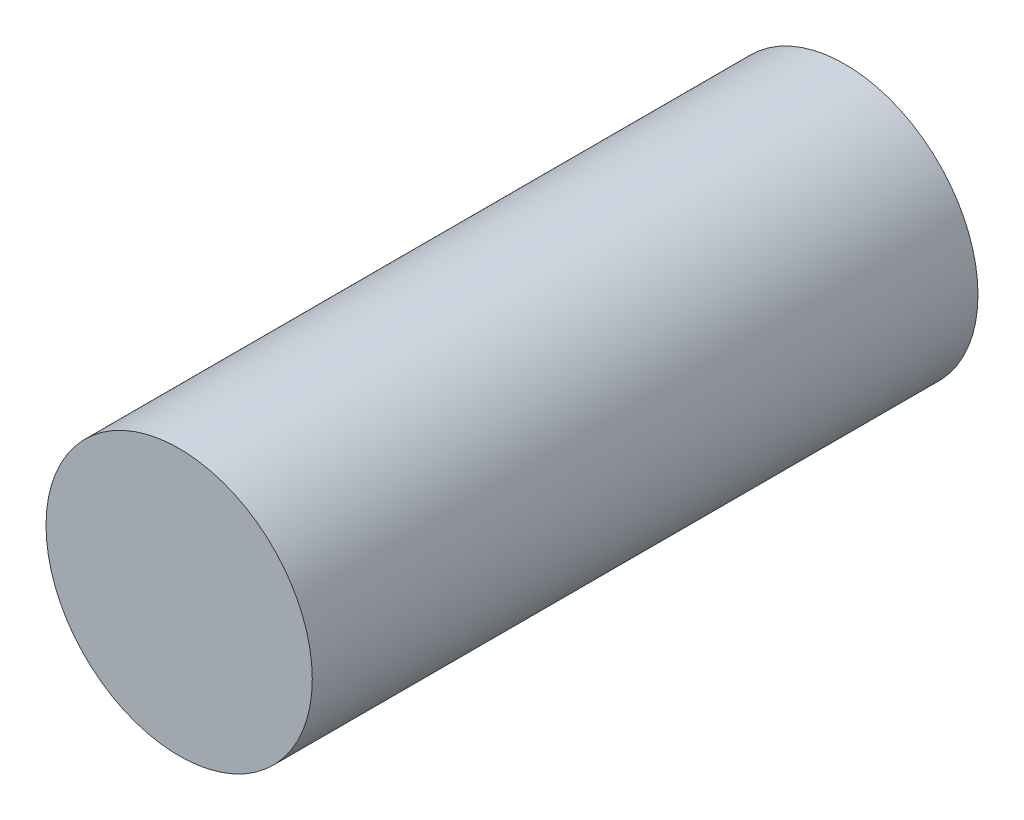
ISO-10303-21;
HEADER;
FILE_DESCRIPTION(('STEP AP214'),'2;1');
FILE_NAME('part.step','',(''),(''),'','','');
FILE_SCHEMA(('AUTOMOTIVE_DESIGN { 1 0 10303 214 1 1 1 1 }'));
ENDSEC;
DATA;
#1=APPLICATION_CONTEXT('core data for automotive mechanical design processes');
#2=APPLICATION_PROTOCOL_DEFINITION('international standard','automotive_design',2000,#1);
#3=PRODUCT_CONTEXT('',#1,'mechanical');
#4=PRODUCT('Part','Part','',(#3));
#5=PRODUCT_RELATED_PRODUCT_CATEGORY('part','',(#4));
#6=PRODUCT_DEFINITION_FORMATION('','',#4);
#7=PRODUCT_DEFINITION_CONTEXT('part definition',#1,'design');
#8=PRODUCT_DEFINITION('design','',#6,#7);
#9=PRODUCT_DEFINITION_SHAPE('','',#8);
#10=(LENGTH_UNIT() NAMED_UNIT(*) SI_UNIT(.MILLI.,.METRE.));
#11=(NAMED_UNIT(*) PLANE_ANGLE_UNIT() SI_UNIT($,.RADIAN.));
#12=(NAMED_UNIT(*) SI_UNIT($,.STERADIAN.) SOLID_ANGLE_UNIT());
#13=UNCERTAINTY_MEASURE_WITH_UNIT(LENGTH_MEASURE(1.E-05),#10,'distance_accuracy_value','');
#14=(GEOMETRIC_REPRESENTATION_CONTEXT(3) GLOBAL_UNCERTAINTY_ASSIGNED_CONTEXT((#13)) GLOBAL_UNIT_ASSIGNED_CONTEXT((#10,
#11,#12)) REPRESENTATION_CONTEXT('',''));
#15=CARTESIAN_POINT('',(0.,0.,0.));
#16=DIRECTION('',(0.,0.,1.));
#17=DIRECTION('',(1.,0.,0.));
#18=AXIS2_PLACEMENT_3D('',#15,#16,#17);
#19=CARTESIAN_POINT('',(0.,0.,100.));
#20=DIRECTION('',(0.,0.,-1.));
#21=DIRECTION('',(-1.,0.,0.));
#22=AXIS2_PLACEMENT_3D('',#19,#20,#21);
#23=CYLINDRICAL_SURFACE('',#22,20.);
#24=CARTESIAN_POINT('',(0.,0.,100.));
#25=DIRECTION('',(0.,0.,1.));
#26=DIRECTION('',(1.,0.,0.));
#27=AXIS2_PLACEMENT_3D('',#24,#25,#26);
#28=CIRCLE('',#27,20.);
#29=CARTESIAN_POINT('',(20.,0.,100.));
#30=VERTEX_POINT('',#29);
#31=EDGE_CURVE('E10',#30,#30,#28,.T.);
#32=ORIENTED_EDGE('',*,*,#31,.F.);
#33=EDGE_LOOP('',(#32));
#34=FACE_BOUND('',#33,.T.);
#35=CARTESIAN_POINT('',(0.,0.,0.));
#36=DIRECTION('',(0.,0.,1.));
#37=DIRECTION('',(1.,0.,0.));
#38=AXIS2_PLACEMENT_3D('',#35,#36,#37);
#39=CIRCLE('',#38,20.);
#40=CARTESIAN_POINT('',(20.,0.,0.));
#41=VERTEX_POINT('',#40);
#42=EDGE_CURVE('E36',#41,#41,#39,.T.);
#43=ORIENTED_EDGE('',*,*,#42,.T.);
#44=EDGE_LOOP('',(#43));
#45=FACE_BOUND('',#44,.T.);
#46=ADVANCED_FACE('F33',(#34,#45),#23,.T.);
#47=CARTESIAN_POINT('',(0.,0.,100.));
#48=DIRECTION('',(0.,0.,1.));
#49=DIRECTION('',(1.,0.,0.));
#50=AXIS2_PLACEMENT_3D('',#47,#48,#49);
#51=PLANE('',#50);
#52=ORIENTED_EDGE('',*,*,#31,.T.);
#53=EDGE_LOOP('',(#52));
#54=FACE_BOUND('',#53,.T.);
#55=ADVANCED_FACE('F48',(#54),#51,.T.);
#56=CARTESIAN_POINT('',(0.,0.,0.));
#57=DIRECTION('',(0.,0.,1.));
#58=DIRECTION('',(1.,0.,0.));
#59=AXIS2_PLACEMENT_3D('',#56,#57,#58);
#60=PLANE('',#59);
#61=ORIENTED_EDGE('',*,*,#42,.F.);
#62=EDGE_LOOP('',(#61));
#63=FACE_BOUND('',#62,.T.);
#64=ADVANCED_FACE('F46',(#63),#60,.F.);
#65=CLOSED_SHELL('',(#46,#55,#64));
#66=MANIFOLD_SOLID_BREP('B2',#65);
#67=ADVANCED_BREP_SHAPE_REPRESENTATION('',(#18,#66),#14);
#68=SHAPE_DEFINITION_REPRESENTATION(#9,#67);
ENDSEC;
END-ISO-10303-21;
